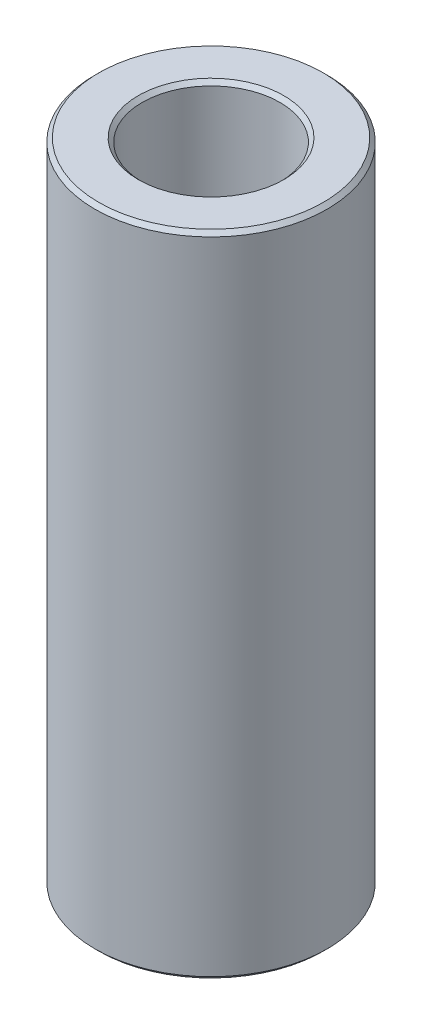
ISO-10303-21;
HEADER;
FILE_DESCRIPTION(('STEP AP214'),'2;1');
FILE_NAME('part.step','',(''),(''),'','','');
FILE_SCHEMA(('AUTOMOTIVE_DESIGN { 1 0 10303 214 1 1 1 1 }'));
ENDSEC;
DATA;
#1=APPLICATION_CONTEXT('core data for automotive mechanical design processes');
#2=APPLICATION_PROTOCOL_DEFINITION('international standard','automotive_design',2000,#1);
#3=PRODUCT_CONTEXT('',#1,'mechanical');
#4=PRODUCT('Part','Part','',(#3));
#5=PRODUCT_RELATED_PRODUCT_CATEGORY('part','',(#4));
#6=PRODUCT_DEFINITION_FORMATION('','',#4);
#7=PRODUCT_DEFINITION_CONTEXT('part definition',#1,'design');
#8=PRODUCT_DEFINITION('design','',#6,#7);
#9=PRODUCT_DEFINITION_SHAPE('','',#8);
#10=(LENGTH_UNIT() NAMED_UNIT(*) SI_UNIT(.MILLI.,.METRE.));
#11=(NAMED_UNIT(*) PLANE_ANGLE_UNIT() SI_UNIT($,.RADIAN.));
#12=(NAMED_UNIT(*) SI_UNIT($,.STERADIAN.) SOLID_ANGLE_UNIT());
#13=UNCERTAINTY_MEASURE_WITH_UNIT(LENGTH_MEASURE(1.E-05),#10,'distance_accuracy_value','');
#14=(GEOMETRIC_REPRESENTATION_CONTEXT(3) GLOBAL_UNCERTAINTY_ASSIGNED_CONTEXT((#13)) GLOBAL_UNIT_ASSIGNED_CONTEXT((#10,
#11,#12)) REPRESENTATION_CONTEXT('',''));
#15=CARTESIAN_POINT('',(0.,0.,0.));
#16=DIRECTION('',(0.,0.,1.));
#17=DIRECTION('',(1.,0.,0.));
#18=AXIS2_PLACEMENT_3D('',#15,#16,#17);
#19=CARTESIAN_POINT('',(0.,293.05801973015,0.));
#20=DIRECTION('',(0.,-1.,0.));
#21=DIRECTION('',(0.,0.,-1.));
#22=AXIS2_PLACEMENT_3D('',#19,#20,#21);
#23=CYLINDRICAL_SURFACE('',#22,52.5);
#24=CARTESIAN_POINT('',(0.,1.77300051971035,0.));
#25=DIRECTION('',(0.,1.,0.));
#26=DIRECTION('',(0.,0.,1.));
#27=AXIS2_PLACEMENT_3D('',#24,#25,#26);
#28=CIRCLE('',#27,52.5);
#29=CARTESIAN_POINT('',(0.,1.77300051971035,52.5));
#30=VERTEX_POINT('',#29);
#31=EDGE_CURVE('E10',#30,#30,#28,.T.);
#32=ORIENTED_EDGE('',*,*,#31,.T.);
#33=EDGE_LOOP('',(#32));
#34=FACE_BOUND('',#33,.T.);
#35=CARTESIAN_POINT('',(0.,291.28501921044,0.));
#36=DIRECTION('',(0.,1.,0.));
#37=DIRECTION('',(0.,0.,1.));
#38=AXIS2_PLACEMENT_3D('',#35,#36,#37);
#39=CIRCLE('',#38,52.5);
#40=CARTESIAN_POINT('',(0.,291.28501921044,52.5));
#41=VERTEX_POINT('',#40);
#42=EDGE_CURVE('E50',#41,#41,#39,.F.);
#43=ORIENTED_EDGE('',*,*,#42,.T.);
#44=EDGE_LOOP('',(#43));
#45=FACE_BOUND('',#44,.T.);
#46=ADVANCED_FACE('F39',(#34,#45),#23,.T.);
#47=CARTESIAN_POINT('',(0.,293.05801973015,0.));
#48=DIRECTION('',(0.,1.,0.));
#49=DIRECTION('',(0.,0.,1.));
#50=AXIS2_PLACEMENT_3D('',#47,#48,#49);
#51=PLANE('',#50);
#52=CARTESIAN_POINT('',(0.,293.05801973015,0.));
#53=DIRECTION('',(0.,1.,0.));
#54=DIRECTION('',(0.,0.,1.));
#55=AXIS2_PLACEMENT_3D('',#52,#53,#54);
#56=CIRCLE('',#55,32.901655412152);
#57=CARTESIAN_POINT('',(0.,293.05801973015,32.901655412152));
#58=VERTEX_POINT('',#57);
#59=EDGE_CURVE('E58',#58,#58,#56,.F.);
#60=ORIENTED_EDGE('',*,*,#59,.T.);
#61=EDGE_LOOP('',(#60));
#62=FACE_BOUND('',#61,.T.);
#63=CARTESIAN_POINT('',(0.,293.05801973015,0.));
#64=DIRECTION('',(0.,1.,0.));
#65=DIRECTION('',(0.,0.,1.));
#66=AXIS2_PLACEMENT_3D('',#63,#64,#65);
#67=CIRCLE('',#66,50.7269994802896);
#68=CARTESIAN_POINT('',(0.,293.05801973015,50.7269994802896));
#69=VERTEX_POINT('',#68);
#70=EDGE_CURVE('E61',#69,#69,#67,.T.);
#71=ORIENTED_EDGE('',*,*,#70,.T.);
#72=EDGE_LOOP('',(#71));
#73=FACE_BOUND('',#72,.T.);
#74=ADVANCED_FACE('F88',(#62,#73),#51,.T.);
#75=CARTESIAN_POINT('',(0.,0.,0.));
#76=DIRECTION('',(0.,1.,0.));
#77=DIRECTION('',(0.,0.,1.));
#78=AXIS2_PLACEMENT_3D('',#75,#76,#77);
#79=PLANE('',#78);
#80=CARTESIAN_POINT('',(0.,0.,0.));
#81=DIRECTION('',(0.,1.,0.));
#82=DIRECTION('',(0.,0.,1.));
#83=AXIS2_PLACEMENT_3D('',#80,#81,#82);
#84=CIRCLE('',#83,32.9016554121521);
#85=CARTESIAN_POINT('',(0.,0.,-32.9016554121521));
#86=VERTEX_POINT('',#85);
#87=EDGE_CURVE('E51',#86,#86,#84,.T.);
#88=ORIENTED_EDGE('',*,*,#87,.T.);
#89=EDGE_LOOP('',(#88));
#90=FACE_BOUND('',#89,.T.);
#91=CARTESIAN_POINT('',(0.,0.,0.));
#92=DIRECTION('',(0.,1.,0.));
#93=DIRECTION('',(0.,0.,1.));
#94=AXIS2_PLACEMENT_3D('',#91,#92,#93);
#95=CIRCLE('',#94,50.7269994802896);
#96=CARTESIAN_POINT('',(0.,0.,50.7269994802896));
#97=VERTEX_POINT('',#96);
#98=EDGE_CURVE('E54',#97,#97,#95,.F.);
#99=ORIENTED_EDGE('',*,*,#98,.T.);
#100=EDGE_LOOP('',(#99));
#101=FACE_BOUND('',#100,.T.);
#102=ADVANCED_FACE('F83',(#90,#101),#79,.F.);
#103=CARTESIAN_POINT('',(0.,293.05801973015,0.));
#104=DIRECTION('',(0.,-1.,0.));
#105=DIRECTION('',(0.,0.,-1.));
#106=AXIS2_PLACEMENT_3D('',#103,#104,#105);
#107=CYLINDRICAL_SURFACE('',#106,31.1286548924417);
#108=CARTESIAN_POINT('',(0.,291.28501921044,0.));
#109=DIRECTION('',(0.,1.,0.));
#110=DIRECTION('',(0.,0.,1.));
#111=AXIS2_PLACEMENT_3D('',#108,#109,#110);
#112=CIRCLE('',#111,31.1286548924417);
#113=CARTESIAN_POINT('',(0.,291.28501921044,31.1286548924417));
#114=VERTEX_POINT('',#113);
#115=EDGE_CURVE('E67',#114,#114,#112,.T.);
#116=ORIENTED_EDGE('',*,*,#115,.T.);
#117=EDGE_LOOP('',(#116));
#118=FACE_BOUND('',#117,.T.);
#119=CARTESIAN_POINT('',(0.,1.77300051971041,0.));
#120=DIRECTION('',(0.,1.,0.));
#121=DIRECTION('',(0.,0.,1.));
#122=AXIS2_PLACEMENT_3D('',#119,#120,#121);
#123=CIRCLE('',#122,31.1286548924417);
#124=CARTESIAN_POINT('',(0.,1.77300051971041,-31.1286548924417));
#125=VERTEX_POINT('',#124);
#126=EDGE_CURVE('E69',#125,#125,#123,.F.);
#127=ORIENTED_EDGE('',*,*,#126,.T.);
#128=EDGE_LOOP('',(#127));
#129=FACE_BOUND('',#128,.T.);
#130=ADVANCED_FACE('F71',(#118,#129),#107,.F.);
#131=CARTESIAN_POINT('',(0.,291.28501921044,0.));
#132=DIRECTION('',(0.,1.,0.));
#133=DIRECTION('',(0.,0.,1.));
#134=AXIS2_PLACEMENT_3D('',#131,#132,#133);
#135=CONICAL_SURFACE('',#134,31.1286548924417,0.785398163397437);
#136=ORIENTED_EDGE('',*,*,#59,.F.);
#137=EDGE_LOOP('',(#136));
#138=FACE_BOUND('',#137,.T.);
#139=ORIENTED_EDGE('',*,*,#115,.F.);
#140=EDGE_LOOP('',(#139));
#141=FACE_BOUND('',#140,.T.);
#142=ADVANCED_FACE('F77',(#138,#141),#135,.F.);
#143=CARTESIAN_POINT('',(0.,0.,0.));
#144=DIRECTION('',(0.,-1.,0.));
#145=DIRECTION('',(0.,0.,-1.));
#146=AXIS2_PLACEMENT_3D('',#143,#144,#145);
#147=CONICAL_SURFACE('',#146,32.9016554121521,0.785398163397444);
#148=CARTESIAN_POINT('',(0.,1.77300051971041,-31.1286548924417));
#149=CARTESIAN_POINT('',(0.,1.75453176429676,-31.1471236478554));
#150=CARTESIAN_POINT('',(0.,1.73606300888311,-31.165592403269));
#151=CARTESIAN_POINT('',(0.,1.69912549805581,-31.2025299140963));
#152=CARTESIAN_POINT('',(0.,1.68065674264216,-31.22099866951));
#153=CARTESIAN_POINT('',(0.,1.64371923181486,-31.2579361803373));
#154=CARTESIAN_POINT('',(0.,1.62525047640121,-31.2764049357509));
#155=CARTESIAN_POINT('',(0.,1.58831296557391,-31.3133424465782));
#156=CARTESIAN_POINT('',(0.,1.56984421016026,-31.3318112019919));
#157=CARTESIAN_POINT('',(0.,1.53290669933296,-31.3687487128192));
#158=CARTESIAN_POINT('',(0.,1.51443794391931,-31.3872174682328));
#159=CARTESIAN_POINT('',(0.,1.47750043309201,-31.4241549790601));
#160=CARTESIAN_POINT('',(0.,1.45903167767836,-31.4426237344738));
#161=CARTESIAN_POINT('',(0.,1.42209416685106,-31.4795612453011));
#162=CARTESIAN_POINT('',(0.,1.40362541143741,-31.4980300007147));
#163=CARTESIAN_POINT('',(0.,1.36668790061011,-31.534967511542));
#164=CARTESIAN_POINT('',(0.,1.34821914519646,-31.5534362669557));
#165=CARTESIAN_POINT('',(0.,1.31128163436916,-31.590373777783));
#166=CARTESIAN_POINT('',(0.,1.29281287895551,-31.6088425331966));
#167=CARTESIAN_POINT('',(0.,1.25587536812821,-31.6457800440239));
#168=CARTESIAN_POINT('',(0.,1.23740661271456,-31.6642487994376));
#169=CARTESIAN_POINT('',(0.,1.20046910188726,-31.7011863102649));
#170=CARTESIAN_POINT('',(0.,1.18200034647361,-31.7196550656785));
#171=CARTESIAN_POINT('',(0.,1.14506283564631,-31.7565925765058));
#172=CARTESIAN_POINT('',(0.,1.12659408023266,-31.7750613319195));
#173=CARTESIAN_POINT('',(0.,1.08965656940536,-31.8119988427468));
#174=CARTESIAN_POINT('',(0.,1.07118781399171,-31.8304675981604));
#175=CARTESIAN_POINT('',(0.,1.03425030316441,-31.8674051089877));
#176=CARTESIAN_POINT('',(0.,1.01578154775076,-31.8858738644014));
#177=CARTESIAN_POINT('',(0.,0.978844036923455,-31.9228113752287));
#178=CARTESIAN_POINT('',(0.,0.960375281509806,-31.9412801306423));
#179=CARTESIAN_POINT('',(0.,0.923437770682506,-31.9782176414696));
#180=CARTESIAN_POINT('',(0.,0.904969015268856,-31.9966863968833));
#181=CARTESIAN_POINT('',(0.,0.868031504441555,-32.0336239077106));
#182=CARTESIAN_POINT('',(0.,0.849562749027904,-32.0520926631242));
#183=CARTESIAN_POINT('',(0.,0.812625238200604,-32.0890301739515));
#184=CARTESIAN_POINT('',(0.,0.794156482786955,-32.1074989293652));
#185=CARTESIAN_POINT('',(0.,0.757218971959655,-32.1444364401925));
#186=CARTESIAN_POINT('',(0.,0.738750216546004,-32.1629051956061));
#187=CARTESIAN_POINT('',(0.,0.701812705718703,-32.1998427064334));
#188=CARTESIAN_POINT('',(0.,0.683343950305054,-32.2183114618471));
#189=CARTESIAN_POINT('',(0.,0.646406439477754,-32.2552489726744));
#190=CARTESIAN_POINT('',(0.,0.627937684064103,-32.273717728088));
#191=CARTESIAN_POINT('',(0.,0.591000173236803,-32.3106552389153));
#192=CARTESIAN_POINT('',(0.,0.572531417823154,-32.329123994329));
#193=CARTESIAN_POINT('',(0.,0.535593906995854,-32.3660615051563));
#194=CARTESIAN_POINT('',(0.,0.517125151582203,-32.3845302605699));
#195=CARTESIAN_POINT('',(0.,0.480187640754902,-32.4214677713972));
#196=CARTESIAN_POINT('',(0.,0.461718885341252,-32.4399365268109));
#197=CARTESIAN_POINT('',(0.,0.424781374513952,-32.4768740376382));
#198=CARTESIAN_POINT('',(0.,0.406312619100303,-32.4953427930518));
#199=CARTESIAN_POINT('',(0.,0.369375108273003,-32.5322803038791));
#200=CARTESIAN_POINT('',(0.,0.350906352859351,-32.5507490592928));
#201=CARTESIAN_POINT('',(0.,0.313968842032051,-32.5876865701201));
#202=CARTESIAN_POINT('',(0.,0.295500086618402,-32.6061553255337));
#203=CARTESIAN_POINT('',(0.,0.258562575791102,-32.643092836361));
#204=CARTESIAN_POINT('',(0.,0.240093820377451,-32.6615615917747));
#205=CARTESIAN_POINT('',(0.,0.203156309550151,-32.698499102602));
#206=CARTESIAN_POINT('',(0.,0.184687554136502,-32.7169678580156));
#207=CARTESIAN_POINT('',(0.,0.147750043309201,-32.7539053688429));
#208=CARTESIAN_POINT('',(0.,0.12928128789555,-32.7723741242566));
#209=CARTESIAN_POINT('',(0.,0.0923437770682498,-32.8093116350839));
#210=CARTESIAN_POINT('',(0.,0.0738750216546003,-32.8277803904975));
#211=CARTESIAN_POINT('',(0.,0.0369375108273015,-32.8647179013248));
#212=CARTESIAN_POINT('',(0.,0.018468755413652,-32.8831866567385));
#213=CARTESIAN_POINT('',(0.,0.,-32.9016554121521));
#214=B_SPLINE_CURVE_WITH_KNOTS('',3,(#148,#149,#150,#151,#152,#153,#154,#155,#156,#157,#158,
#159,#160,#161,#162,#163,#164,#165,#166,#167,#168,#169,#170,#171,#172,#173,#174,#175,#176,#177,
#178,#179,#180,#181,#182,#183,#184,#185,#186,#187,#188,#189,#190,#191,#192,#193,#194,#195,#196,
#197,#198,#199,#200,#201,#202,#203,#204,#205,#206,#207,#208,#209,#210,#211,#212,#213),
.UNSPECIFIED.,.F.,.F.,(4,2,2,2,2,2,2,2,2,2,2,2,2,2,2,2,2,2,2,2,2,2,2,2,2,2,2,2,2,2,2,2,4),(0.,
0.0783562931584065,0.156712586316813,0.235068879475217,0.313425172633626,0.39178146579203,
0.470137758950439,0.548494052108843,0.626850345267252,0.705206638425656,0.78356293158406,
0.861919224742469,0.940275517900873,1.01863181105928,1.09698810421769,1.1753443973761,
1.2537006905345,1.3320569836929,1.41041327685131,1.48876957000972,1.56712586316813,
1.64548215632653,1.72383844948494,1.80219474264334,1.88055103580175,1.95890732896016,
2.03726362211856,2.11561991527697,2.19397620843537,2.27233250159378,2.35068879475219,
2.4290450879106,2.507401381069),.UNSPECIFIED.);
#215=EDGE_CURVE('BSEAM73',#125,#86,#214,.T.);
#216=ORIENTED_EDGE('',*,*,#126,.F.);
#217=ORIENTED_EDGE('',*,*,#87,.F.);
#218=ORIENTED_EDGE('',*,*,#215,.T.);
#219=ORIENTED_EDGE('',*,*,#215,.F.);
#220=EDGE_LOOP('',(#216,#218,#217,#219));
#221=FACE_BOUND('',#220,.T.);
#222=ADVANCED_FACE('F73',(#221),#147,.F.);
#223=CARTESIAN_POINT('',(0.,1.77300051971035,0.));
#224=DIRECTION('',(0.,1.,0.));
#225=DIRECTION('',(0.,0.,1.));
#226=AXIS2_PLACEMENT_3D('',#223,#224,#225);
#227=CONICAL_SURFACE('',#226,52.5,0.78539816339745);
#228=ORIENTED_EDGE('',*,*,#98,.F.);
#229=EDGE_LOOP('',(#228));
#230=FACE_BOUND('',#229,.T.);
#231=ORIENTED_EDGE('',*,*,#31,.F.);
#232=EDGE_LOOP('',(#231));
#233=FACE_BOUND('',#232,.T.);
#234=ADVANCED_FACE('F76',(#230,#233),#227,.T.);
#235=CARTESIAN_POINT('',(0.,293.05801973015,0.));
#236=DIRECTION('',(0.,-1.,0.));
#237=DIRECTION('',(0.,0.,-1.));
#238=AXIS2_PLACEMENT_3D('',#235,#236,#237);
#239=CONICAL_SURFACE('',#238,50.7269994802896,0.785398163397456);
#240=ORIENTED_EDGE('',*,*,#42,.F.);
#241=EDGE_LOOP('',(#240));
#242=FACE_BOUND('',#241,.T.);
#243=ORIENTED_EDGE('',*,*,#70,.F.);
#244=EDGE_LOOP('',(#243));
#245=FACE_BOUND('',#244,.T.);
#246=ADVANCED_FACE('F45',(#242,#245),#239,.T.);
#247=CLOSED_SHELL('',(#46,#74,#102,#130,#142,#222,#234,#246));
#248=MANIFOLD_SOLID_BREP('B2',#247);
#249=ADVANCED_BREP_SHAPE_REPRESENTATION('',(#18,#248),#14);
#250=SHAPE_DEFINITION_REPRESENTATION(#9,#249);
ENDSEC;
END-ISO-10303-21;
